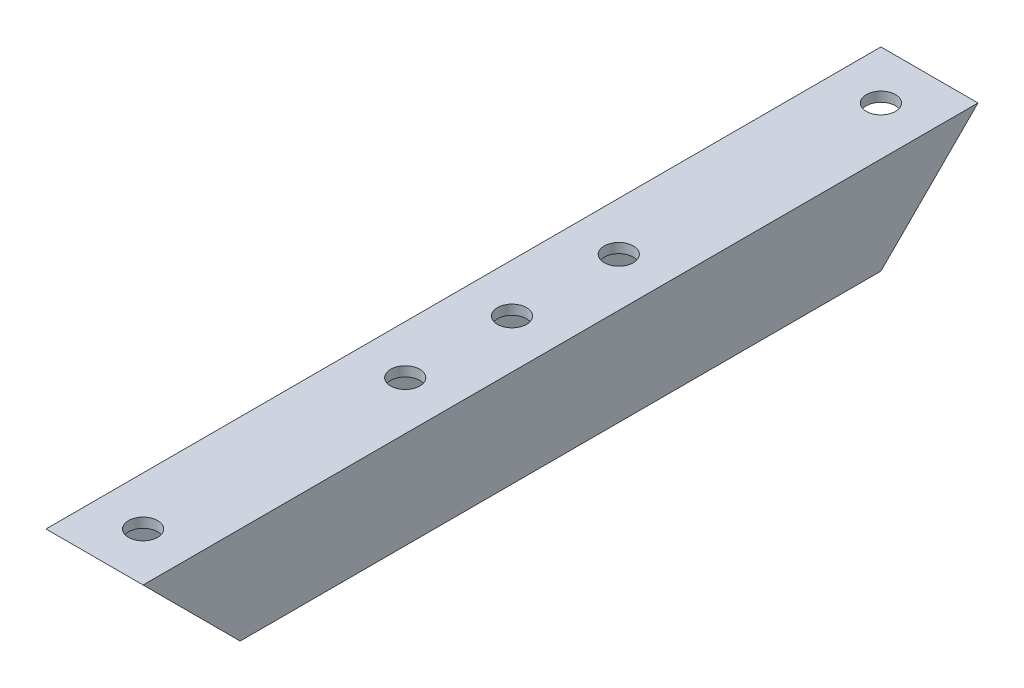
ISO-10303-21;
HEADER;
FILE_DESCRIPTION(('STEP AP214'),'2;1');
FILE_NAME('part.step','',(''),(''),'','','');
FILE_SCHEMA(('AUTOMOTIVE_DESIGN { 1 0 10303 214 1 1 1 1 }'));
ENDSEC;
DATA;
#1=APPLICATION_CONTEXT('core data for automotive mechanical design processes');
#2=APPLICATION_PROTOCOL_DEFINITION('international standard','automotive_design',2000,#1);
#3=PRODUCT_CONTEXT('',#1,'mechanical');
#4=PRODUCT('Part','Part','',(#3));
#5=PRODUCT_RELATED_PRODUCT_CATEGORY('part','',(#4));
#6=PRODUCT_DEFINITION_FORMATION('','',#4);
#7=PRODUCT_DEFINITION_CONTEXT('part definition',#1,'design');
#8=PRODUCT_DEFINITION('design','',#6,#7);
#9=PRODUCT_DEFINITION_SHAPE('','',#8);
#10=(LENGTH_UNIT() NAMED_UNIT(*) SI_UNIT(.MILLI.,.METRE.));
#11=(NAMED_UNIT(*) PLANE_ANGLE_UNIT() SI_UNIT($,.RADIAN.));
#12=(NAMED_UNIT(*) SI_UNIT($,.STERADIAN.) SOLID_ANGLE_UNIT());
#13=UNCERTAINTY_MEASURE_WITH_UNIT(LENGTH_MEASURE(1.E-05),#10,'distance_accuracy_value','');
#14=(GEOMETRIC_REPRESENTATION_CONTEXT(3) GLOBAL_UNCERTAINTY_ASSIGNED_CONTEXT((#13)) GLOBAL_UNIT_ASSIGNED_CONTEXT((#10,
#11,#12)) REPRESENTATION_CONTEXT('',''));
#15=CARTESIAN_POINT('',(0.,0.,0.));
#16=DIRECTION('',(0.,0.,1.));
#17=DIRECTION('',(1.,0.,0.));
#18=AXIS2_PLACEMENT_3D('',#15,#16,#17);
#19=CARTESIAN_POINT('',(-5.,5.,86.));
#20=DIRECTION('',(1.,0.,0.));
#21=DIRECTION('',(0.,0.,-1.));
#22=AXIS2_PLACEMENT_3D('',#19,#20,#21);
#23=PLANE('',#22);
#24=DIRECTION('',(0.,0.,-1.));
#25=VECTOR('',#24,1.);
#26=CARTESIAN_POINT('',(-5.,-5.,86.));
#27=LINE('',#26,#25);
#28=CARTESIAN_POINT('',(-4.99999999999999,-5.,76.0000000000001));
#29=VERTEX_POINT('',#28);
#30=CARTESIAN_POINT('',(-4.99999999999999,-5.,9.99999999999983));
#31=VERTEX_POINT('',#30);
#32=EDGE_CURVE('E143',#29,#31,#27,.T.);
#33=ORIENTED_EDGE('',*,*,#32,.F.);
#34=DIRECTION('',(0.,0.707106781186551,0.707106781186544));
#35=VECTOR('',#34,1.);
#36=CARTESIAN_POINT('',(-4.99999999999999,5.,86.));
#37=LINE('',#36,#35);
#38=CARTESIAN_POINT('',(-4.99999999999999,5.,86.));
#39=VERTEX_POINT('',#38);
#40=EDGE_CURVE('E125',#29,#39,#37,.T.);
#41=ORIENTED_EDGE('',*,*,#40,.T.);
#42=DIRECTION('',(0.,0.,-1.));
#43=VECTOR('',#42,1.);
#44=CARTESIAN_POINT('',(-5.,5.,86.));
#45=LINE('',#44,#43);
#46=CARTESIAN_POINT('',(-5.,5.,0.));
#47=VERTEX_POINT('',#46);
#48=EDGE_CURVE('E197',#39,#47,#45,.T.);
#49=ORIENTED_EDGE('',*,*,#48,.T.);
#50=DIRECTION('',(0.,-0.707106781186554,0.707106781186541));
#51=VECTOR('',#50,1.);
#52=CARTESIAN_POINT('',(-4.99999999999999,5.,0.));
#53=LINE('',#52,#51);
#54=EDGE_CURVE('E148',#47,#31,#53,.T.);
#55=ORIENTED_EDGE('',*,*,#54,.T.);
#56=EDGE_LOOP('',(#33,#41,#49,#55));
#57=FACE_BOUND('',#56,.T.);
#58=ADVANCED_FACE('F63',(#57),#23,.F.);
#59=CARTESIAN_POINT('',(-5.,-5.,86.));
#60=DIRECTION('',(0.,1.,0.));
#61=DIRECTION('',(0.,0.,1.));
#62=AXIS2_PLACEMENT_3D('',#59,#60,#61);
#63=PLANE('',#62);
#64=CARTESIAN_POINT('',(0.,-5.,32.));
#65=DIRECTION('',(0.,1.,0.));
#66=DIRECTION('',(0.,0.,1.));
#67=AXIS2_PLACEMENT_3D('',#64,#65,#66);
#68=CIRCLE('',#67,1.5);
#69=CARTESIAN_POINT('',(0.,-5.,33.5));
#70=VERTEX_POINT('',#69);
#71=EDGE_CURVE('E235',#70,#70,#68,.T.);
#72=ORIENTED_EDGE('',*,*,#71,.T.);
#73=EDGE_LOOP('',(#72));
#74=FACE_BOUND('',#73,.T.);
#75=CARTESIAN_POINT('',(0.,-5.,43.));
#76=DIRECTION('',(0.,1.,0.));
#77=DIRECTION('',(0.,0.,1.));
#78=AXIS2_PLACEMENT_3D('',#75,#76,#77);
#79=CIRCLE('',#78,1.5);
#80=CARTESIAN_POINT('',(0.,-5.,44.5));
#81=VERTEX_POINT('',#80);
#82=EDGE_CURVE('E228',#81,#81,#79,.T.);
#83=ORIENTED_EDGE('',*,*,#82,.T.);
#84=EDGE_LOOP('',(#83));
#85=FACE_BOUND('',#84,.T.);
#86=CARTESIAN_POINT('',(0.,-5.,54.));
#87=DIRECTION('',(0.,1.,0.));
#88=DIRECTION('',(0.,0.,1.));
#89=AXIS2_PLACEMENT_3D('',#86,#87,#88);
#90=CIRCLE('',#89,1.5);
#91=CARTESIAN_POINT('',(0.,-5.,55.5));
#92=VERTEX_POINT('',#91);
#93=EDGE_CURVE('E158',#92,#92,#90,.T.);
#94=ORIENTED_EDGE('',*,*,#93,.T.);
#95=EDGE_LOOP('',(#94));
#96=FACE_BOUND('',#95,.T.);
#97=DIRECTION('',(0.,0.,-1.));
#98=VECTOR('',#97,1.);
#99=CARTESIAN_POINT('',(5.00000000000001,-5.,86.));
#100=LINE('',#99,#98);
#101=CARTESIAN_POINT('',(5.00000000000001,-5.,76.0000000000001));
#102=VERTEX_POINT('',#101);
#103=CARTESIAN_POINT('',(5.00000000000001,-5.,9.99999999999983));
#104=VERTEX_POINT('',#103);
#105=EDGE_CURVE('E145',#102,#104,#100,.T.);
#106=ORIENTED_EDGE('',*,*,#105,.F.);
#107=DIRECTION('',(1.,0.,0.));
#108=VECTOR('',#107,1.);
#109=CARTESIAN_POINT('',(-4.99999999999999,-5.,76.0000000000001));
#110=LINE('',#109,#108);
#111=EDGE_CURVE('E128',#29,#102,#110,.T.);
#112=ORIENTED_EDGE('',*,*,#111,.F.);
#113=ORIENTED_EDGE('',*,*,#32,.T.);
#114=DIRECTION('',(1.,0.,0.));
#115=VECTOR('',#114,1.);
#116=CARTESIAN_POINT('',(-4.99999999999999,-5.,9.99999999999983));
#117=LINE('',#116,#115);
#118=EDGE_CURVE('E210',#31,#104,#117,.T.);
#119=ORIENTED_EDGE('',*,*,#118,.T.);
#120=EDGE_LOOP('',(#106,#112,#113,#119));
#121=FACE_BOUND('',#120,.T.);
#122=ADVANCED_FACE('F141',(#74,#85,#96,#121),#63,.F.);
#123=CARTESIAN_POINT('',(5.00000000000001,5.,86.));
#124=DIRECTION('',(-1.,0.,0.));
#125=DIRECTION('',(0.,0.,1.));
#126=AXIS2_PLACEMENT_3D('',#123,#124,#125);
#127=PLANE('',#126);
#128=DIRECTION('',(0.,0.,-1.));
#129=VECTOR('',#128,1.);
#130=CARTESIAN_POINT('',(5.00000000000001,5.,86.));
#131=LINE('',#130,#129);
#132=CARTESIAN_POINT('',(5.00000000000001,5.,86.));
#133=VERTEX_POINT('',#132);
#134=CARTESIAN_POINT('',(5.00000000000001,5.,0.));
#135=VERTEX_POINT('',#134);
#136=EDGE_CURVE('E150',#133,#135,#131,.T.);
#137=ORIENTED_EDGE('',*,*,#136,.F.);
#138=DIRECTION('',(0.,0.707106781186551,0.707106781186544));
#139=VECTOR('',#138,1.);
#140=CARTESIAN_POINT('',(5.00000000000001,5.,86.));
#141=LINE('',#140,#139);
#142=EDGE_CURVE('E136',#102,#133,#141,.T.);
#143=ORIENTED_EDGE('',*,*,#142,.F.);
#144=ORIENTED_EDGE('',*,*,#105,.T.);
#145=DIRECTION('',(0.,-0.707106781186554,0.707106781186541));
#146=VECTOR('',#145,1.);
#147=CARTESIAN_POINT('',(5.00000000000001,5.,0.));
#148=LINE('',#147,#146);
#149=EDGE_CURVE('E207',#135,#104,#148,.T.);
#150=ORIENTED_EDGE('',*,*,#149,.F.);
#151=EDGE_LOOP('',(#137,#143,#144,#150));
#152=FACE_BOUND('',#151,.T.);
#153=ADVANCED_FACE('F206',(#152),#127,.F.);
#154=CARTESIAN_POINT('',(-5.,5.,86.));
#155=DIRECTION('',(0.,-1.,0.));
#156=DIRECTION('',(0.,0.,-1.));
#157=AXIS2_PLACEMENT_3D('',#154,#155,#156);
#158=PLANE('',#157);
#159=CARTESIAN_POINT('',(0.,5.,32.));
#160=DIRECTION('',(0.,1.,0.));
#161=DIRECTION('',(0.,0.,1.));
#162=AXIS2_PLACEMENT_3D('',#159,#160,#161);
#163=CIRCLE('',#162,1.5);
#164=CARTESIAN_POINT('',(0.,5.,33.5));
#165=VERTEX_POINT('',#164);
#166=EDGE_CURVE('E231',#165,#165,#163,.T.);
#167=ORIENTED_EDGE('',*,*,#166,.F.);
#168=EDGE_LOOP('',(#167));
#169=FACE_BOUND('',#168,.T.);
#170=CARTESIAN_POINT('',(0.,5.,43.));
#171=DIRECTION('',(0.,1.,0.));
#172=DIRECTION('',(0.,0.,1.));
#173=AXIS2_PLACEMENT_3D('',#170,#171,#172);
#174=CIRCLE('',#173,1.5);
#175=CARTESIAN_POINT('',(0.,5.,44.5));
#176=VERTEX_POINT('',#175);
#177=EDGE_CURVE('E238',#176,#176,#174,.T.);
#178=ORIENTED_EDGE('',*,*,#177,.F.);
#179=EDGE_LOOP('',(#178));
#180=FACE_BOUND('',#179,.T.);
#181=CARTESIAN_POINT('',(0.,5.,81.));
#182=DIRECTION('',(0.,1.,0.));
#183=DIRECTION('',(0.,0.,1.));
#184=AXIS2_PLACEMENT_3D('',#181,#182,#183);
#185=CIRCLE('',#184,1.5);
#186=CARTESIAN_POINT('',(0.,5.,82.5));
#187=VERTEX_POINT('',#186);
#188=EDGE_CURVE('E225',#187,#187,#185,.T.);
#189=ORIENTED_EDGE('',*,*,#188,.F.);
#190=EDGE_LOOP('',(#189));
#191=FACE_BOUND('',#190,.T.);
#192=CARTESIAN_POINT('',(0.,5.,5.));
#193=DIRECTION('',(0.,1.,0.));
#194=DIRECTION('',(0.,0.,1.));
#195=AXIS2_PLACEMENT_3D('',#192,#193,#194);
#196=CIRCLE('',#195,1.5);
#197=CARTESIAN_POINT('',(0.,5.,6.50000000000001));
#198=VERTEX_POINT('',#197);
#199=EDGE_CURVE('E224',#198,#198,#196,.T.);
#200=ORIENTED_EDGE('',*,*,#199,.F.);
#201=EDGE_LOOP('',(#200));
#202=FACE_BOUND('',#201,.T.);
#203=CARTESIAN_POINT('',(0.,5.,54.));
#204=DIRECTION('',(0.,1.,0.));
#205=DIRECTION('',(0.,0.,1.));
#206=AXIS2_PLACEMENT_3D('',#203,#204,#205);
#207=CIRCLE('',#206,1.5);
#208=CARTESIAN_POINT('',(0.,5.,55.5));
#209=VERTEX_POINT('',#208);
#210=EDGE_CURVE('E234',#209,#209,#207,.T.);
#211=ORIENTED_EDGE('',*,*,#210,.F.);
#212=EDGE_LOOP('',(#211));
#213=FACE_BOUND('',#212,.T.);
#214=DIRECTION('',(-1.,0.,0.));
#215=VECTOR('',#214,1.);
#216=CARTESIAN_POINT('',(-5.,5.,0.));
#217=LINE('',#216,#215);
#218=EDGE_CURVE('E195',#135,#47,#217,.T.);
#219=ORIENTED_EDGE('',*,*,#218,.T.);
#220=ORIENTED_EDGE('',*,*,#48,.F.);
#221=DIRECTION('',(-1.,0.,0.));
#222=VECTOR('',#221,1.);
#223=CARTESIAN_POINT('',(-5.,5.,86.));
#224=LINE('',#223,#222);
#225=EDGE_CURVE('E131',#133,#39,#224,.T.);
#226=ORIENTED_EDGE('',*,*,#225,.F.);
#227=ORIENTED_EDGE('',*,*,#136,.T.);
#228=EDGE_LOOP('',(#219,#220,#226,#227));
#229=FACE_BOUND('',#228,.T.);
#230=ADVANCED_FACE('F203',(#169,#180,#191,#202,#213,#229),#158,.F.);
#231=CARTESIAN_POINT('',(-4.,5.,86.));
#232=DIRECTION('',(1.,0.,0.));
#233=DIRECTION('',(0.,0.,-1.));
#234=AXIS2_PLACEMENT_3D('',#231,#232,#233);
#235=PLANE('',#234);
#236=DIRECTION('',(0.,0.707106781186551,0.707106781186544));
#237=VECTOR('',#236,1.);
#238=CARTESIAN_POINT('',(-4.,5.,86.));
#239=LINE('',#238,#237);
#240=CARTESIAN_POINT('',(-4.,-4.,77.0000000000001));
#241=VERTEX_POINT('',#240);
#242=CARTESIAN_POINT('',(-4.,4.,85.));
#243=VERTEX_POINT('',#242);
#244=EDGE_CURVE('E76',#241,#243,#239,.T.);
#245=ORIENTED_EDGE('',*,*,#244,.F.);
#246=DIRECTION('',(0.,0.,-1.));
#247=VECTOR('',#246,1.);
#248=CARTESIAN_POINT('',(-4.,-4.,86.));
#249=LINE('',#248,#247);
#250=CARTESIAN_POINT('',(-4.,-4.,8.99999999999984));
#251=VERTEX_POINT('',#250);
#252=EDGE_CURVE('E192',#241,#251,#249,.T.);
#253=ORIENTED_EDGE('',*,*,#252,.T.);
#254=DIRECTION('',(0.,-0.707106781186554,0.707106781186541));
#255=VECTOR('',#254,1.);
#256=CARTESIAN_POINT('',(-4.,-38.,42.9999999999992));
#257=LINE('',#256,#255);
#258=CARTESIAN_POINT('',(-4.,4.,0.999999999999973));
#259=VERTEX_POINT('',#258);
#260=EDGE_CURVE('E217',#259,#251,#257,.T.);
#261=ORIENTED_EDGE('',*,*,#260,.F.);
#262=DIRECTION('',(0.,0.,-1.));
#263=VECTOR('',#262,1.);
#264=CARTESIAN_POINT('',(-4.,4.,86.));
#265=LINE('',#264,#263);
#266=EDGE_CURVE('E175',#243,#259,#265,.T.);
#267=ORIENTED_EDGE('',*,*,#266,.F.);
#268=EDGE_LOOP('',(#245,#253,#261,#267));
#269=FACE_BOUND('',#268,.T.);
#270=ADVANCED_FACE('F250',(#269),#235,.T.);
#271=CARTESIAN_POINT('',(-5.,-4.,86.));
#272=DIRECTION('',(0.,1.,0.));
#273=DIRECTION('',(0.,0.,1.));
#274=AXIS2_PLACEMENT_3D('',#271,#272,#273);
#275=PLANE('',#274);
#276=DIRECTION('',(-1.,0.,0.));
#277=VECTOR('',#276,1.);
#278=CARTESIAN_POINT('',(-5.,-4.,77.0000000000001));
#279=LINE('',#278,#277);
#280=CARTESIAN_POINT('',(4.00000000000001,-4.,77.0000000000001));
#281=VERTEX_POINT('',#280);
#282=EDGE_CURVE('E221',#281,#241,#279,.T.);
#283=ORIENTED_EDGE('',*,*,#282,.F.);
#284=DIRECTION('',(0.,0.,-1.));
#285=VECTOR('',#284,1.);
#286=CARTESIAN_POINT('',(4.00000000000001,-4.,86.));
#287=LINE('',#286,#285);
#288=CARTESIAN_POINT('',(4.00000000000001,-4.,8.99999999999985));
#289=VERTEX_POINT('',#288);
#290=EDGE_CURVE('E189',#281,#289,#287,.T.);
#291=ORIENTED_EDGE('',*,*,#290,.T.);
#292=DIRECTION('',(1.,0.,0.));
#293=VECTOR('',#292,1.);
#294=CARTESIAN_POINT('',(-5.,-4.,8.99999999999984));
#295=LINE('',#294,#293);
#296=EDGE_CURVE('E215',#251,#289,#295,.T.);
#297=ORIENTED_EDGE('',*,*,#296,.F.);
#298=ORIENTED_EDGE('',*,*,#252,.F.);
#299=EDGE_LOOP('',(#283,#291,#297,#298));
#300=FACE_BOUND('',#299,.T.);
#301=CARTESIAN_POINT('',(0.,-4.,32.));
#302=DIRECTION('',(0.,1.,0.));
#303=DIRECTION('',(0.,0.,1.));
#304=AXIS2_PLACEMENT_3D('',#301,#302,#303);
#305=CIRCLE('',#304,1.5);
#306=CARTESIAN_POINT('',(0.,-4.,33.5));
#307=VERTEX_POINT('',#306);
#308=EDGE_CURVE('E171',#307,#307,#305,.T.);
#309=ORIENTED_EDGE('',*,*,#308,.F.);
#310=EDGE_LOOP('',(#309));
#311=FACE_BOUND('',#310,.T.);
#312=CARTESIAN_POINT('',(0.,-4.,43.));
#313=DIRECTION('',(0.,1.,0.));
#314=DIRECTION('',(0.,0.,1.));
#315=AXIS2_PLACEMENT_3D('',#312,#313,#314);
#316=CIRCLE('',#315,1.5);
#317=CARTESIAN_POINT('',(0.,-4.,44.5));
#318=VERTEX_POINT('',#317);
#319=EDGE_CURVE('E168',#318,#318,#316,.T.);
#320=ORIENTED_EDGE('',*,*,#319,.F.);
#321=EDGE_LOOP('',(#320));
#322=FACE_BOUND('',#321,.T.);
#323=CARTESIAN_POINT('',(0.,-4.,54.));
#324=DIRECTION('',(0.,1.,0.));
#325=DIRECTION('',(0.,0.,1.));
#326=AXIS2_PLACEMENT_3D('',#323,#324,#325);
#327=CIRCLE('',#326,1.5);
#328=CARTESIAN_POINT('',(0.,-4.,55.5));
#329=VERTEX_POINT('',#328);
#330=EDGE_CURVE('E157',#329,#329,#327,.T.);
#331=ORIENTED_EDGE('',*,*,#330,.F.);
#332=EDGE_LOOP('',(#331));
#333=FACE_BOUND('',#332,.T.);
#334=ADVANCED_FACE('F257',(#300,#311,#322,#333),#275,.T.);
#335=CARTESIAN_POINT('',(4.00000000000001,5.,86.));
#336=DIRECTION('',(-1.,0.,0.));
#337=DIRECTION('',(0.,0.,1.));
#338=AXIS2_PLACEMENT_3D('',#335,#336,#337);
#339=PLANE('',#338);
#340=DIRECTION('',(0.,-0.707106781186551,-0.707106781186544));
#341=VECTOR('',#340,1.);
#342=CARTESIAN_POINT('',(4.00000000000001,5.,86.));
#343=LINE('',#342,#341);
#344=CARTESIAN_POINT('',(4.00000000000001,4.,85.));
#345=VERTEX_POINT('',#344);
#346=EDGE_CURVE('E219',#345,#281,#343,.T.);
#347=ORIENTED_EDGE('',*,*,#346,.F.);
#348=DIRECTION('',(0.,0.,-1.));
#349=VECTOR('',#348,1.);
#350=CARTESIAN_POINT('',(4.00000000000001,4.,86.));
#351=LINE('',#350,#349);
#352=CARTESIAN_POINT('',(4.00000000000001,4.,0.999999999999973));
#353=VERTEX_POINT('',#352);
#354=EDGE_CURVE('E186',#345,#353,#351,.T.);
#355=ORIENTED_EDGE('',*,*,#354,.T.);
#356=DIRECTION('',(0.,0.707106781186554,-0.707106781186541));
#357=VECTOR('',#356,1.);
#358=CARTESIAN_POINT('',(4.00000000000001,-38.,42.9999999999992));
#359=LINE('',#358,#357);
#360=EDGE_CURVE('E84',#289,#353,#359,.T.);
#361=ORIENTED_EDGE('',*,*,#360,.F.);
#362=ORIENTED_EDGE('',*,*,#290,.F.);
#363=EDGE_LOOP('',(#347,#355,#361,#362));
#364=FACE_BOUND('',#363,.T.);
#365=ADVANCED_FACE('F303',(#364),#339,.T.);
#366=CARTESIAN_POINT('',(-5.,4.,86.));
#367=DIRECTION('',(0.,-1.,0.));
#368=DIRECTION('',(0.,0.,-1.));
#369=AXIS2_PLACEMENT_3D('',#366,#367,#368);
#370=PLANE('',#369);
#371=DIRECTION('',(1.,0.,0.));
#372=VECTOR('',#371,1.);
#373=CARTESIAN_POINT('',(-5.,4.,85.));
#374=LINE('',#373,#372);
#375=EDGE_CURVE('E12',#243,#345,#374,.T.);
#376=ORIENTED_EDGE('',*,*,#375,.F.);
#377=ORIENTED_EDGE('',*,*,#266,.T.);
#378=DIRECTION('',(-1.,0.,0.));
#379=VECTOR('',#378,1.);
#380=CARTESIAN_POINT('',(-5.,4.,0.999999999999973));
#381=LINE('',#380,#379);
#382=EDGE_CURVE('E70',#353,#259,#381,.T.);
#383=ORIENTED_EDGE('',*,*,#382,.F.);
#384=ORIENTED_EDGE('',*,*,#354,.F.);
#385=EDGE_LOOP('',(#376,#377,#383,#384));
#386=FACE_BOUND('',#385,.T.);
#387=CARTESIAN_POINT('',(0.,4.,32.));
#388=DIRECTION('',(0.,-1.,0.));
#389=DIRECTION('',(0.,0.,-1.));
#390=AXIS2_PLACEMENT_3D('',#387,#388,#389);
#391=CIRCLE('',#390,1.5);
#392=CARTESIAN_POINT('',(0.,4.,30.5));
#393=VERTEX_POINT('',#392);
#394=EDGE_CURVE('E169',#393,#393,#391,.T.);
#395=ORIENTED_EDGE('',*,*,#394,.F.);
#396=EDGE_LOOP('',(#395));
#397=FACE_BOUND('',#396,.T.);
#398=CARTESIAN_POINT('',(0.,4.,43.));
#399=DIRECTION('',(0.,-1.,0.));
#400=DIRECTION('',(0.,0.,-1.));
#401=AXIS2_PLACEMENT_3D('',#398,#399,#400);
#402=CIRCLE('',#401,1.5);
#403=CARTESIAN_POINT('',(0.,4.,41.5));
#404=VERTEX_POINT('',#403);
#405=EDGE_CURVE('E165',#404,#404,#402,.T.);
#406=ORIENTED_EDGE('',*,*,#405,.F.);
#407=EDGE_LOOP('',(#406));
#408=FACE_BOUND('',#407,.T.);
#409=CARTESIAN_POINT('',(0.,4.,81.));
#410=DIRECTION('',(0.,-1.,0.));
#411=DIRECTION('',(0.,0.,-1.));
#412=AXIS2_PLACEMENT_3D('',#409,#410,#411);
#413=CIRCLE('',#412,1.5);
#414=CARTESIAN_POINT('',(0.,4.,79.5));
#415=VERTEX_POINT('',#414);
#416=EDGE_CURVE('E162',#415,#415,#413,.T.);
#417=ORIENTED_EDGE('',*,*,#416,.F.);
#418=EDGE_LOOP('',(#417));
#419=FACE_BOUND('',#418,.T.);
#420=CARTESIAN_POINT('',(0.,4.,5.));
#421=DIRECTION('',(0.,-1.,0.));
#422=DIRECTION('',(0.,0.,-1.));
#423=AXIS2_PLACEMENT_3D('',#420,#421,#422);
#424=CIRCLE('',#423,1.5);
#425=CARTESIAN_POINT('',(0.,4.,3.5));
#426=VERTEX_POINT('',#425);
#427=EDGE_CURVE('E159',#426,#426,#424,.T.);
#428=ORIENTED_EDGE('',*,*,#427,.F.);
#429=EDGE_LOOP('',(#428));
#430=FACE_BOUND('',#429,.T.);
#431=CARTESIAN_POINT('',(0.,4.,54.));
#432=DIRECTION('',(0.,-1.,0.));
#433=DIRECTION('',(0.,0.,-1.));
#434=AXIS2_PLACEMENT_3D('',#431,#432,#433);
#435=CIRCLE('',#434,1.5);
#436=CARTESIAN_POINT('',(0.,4.,52.5));
#437=VERTEX_POINT('',#436);
#438=EDGE_CURVE('E154',#437,#437,#435,.T.);
#439=ORIENTED_EDGE('',*,*,#438,.F.);
#440=EDGE_LOOP('',(#439));
#441=FACE_BOUND('',#440,.T.);
#442=ADVANCED_FACE('F294',(#386,#397,#408,#419,#430,#441),#370,.T.);
#443=CARTESIAN_POINT('',(0.,-5.,54.));
#444=DIRECTION('',(0.,1.,0.));
#445=DIRECTION('',(0.,0.,1.));
#446=AXIS2_PLACEMENT_3D('',#443,#444,#445);
#447=CYLINDRICAL_SURFACE('',#446,1.5);
#448=ORIENTED_EDGE('',*,*,#438,.T.);
#449=EDGE_LOOP('',(#448));
#450=FACE_BOUND('',#449,.T.);
#451=ORIENTED_EDGE('',*,*,#210,.T.);
#452=EDGE_LOOP('',(#451));
#453=FACE_BOUND('',#452,.T.);
#454=ADVANCED_FACE('F247',(#450,#453),#447,.F.);
#455=CARTESIAN_POINT('',(0.,-5.,5.));
#456=DIRECTION('',(0.,1.,0.));
#457=DIRECTION('',(0.,0.,1.));
#458=AXIS2_PLACEMENT_3D('',#455,#456,#457);
#459=CYLINDRICAL_SURFACE('',#458,1.5);
#460=ORIENTED_EDGE('',*,*,#427,.T.);
#461=EDGE_LOOP('',(#460));
#462=FACE_BOUND('',#461,.T.);
#463=ORIENTED_EDGE('',*,*,#199,.T.);
#464=EDGE_LOOP('',(#463));
#465=FACE_BOUND('',#464,.T.);
#466=ADVANCED_FACE('F293',(#462,#465),#459,.F.);
#467=CARTESIAN_POINT('',(0.,-5.,81.));
#468=DIRECTION('',(0.,1.,0.));
#469=DIRECTION('',(0.,0.,1.));
#470=AXIS2_PLACEMENT_3D('',#467,#468,#469);
#471=CYLINDRICAL_SURFACE('',#470,1.5);
#472=ORIENTED_EDGE('',*,*,#416,.T.);
#473=EDGE_LOOP('',(#472));
#474=FACE_BOUND('',#473,.T.);
#475=ORIENTED_EDGE('',*,*,#188,.T.);
#476=EDGE_LOOP('',(#475));
#477=FACE_BOUND('',#476,.T.);
#478=ADVANCED_FACE('F300',(#474,#477),#471,.F.);
#479=CARTESIAN_POINT('',(0.,-5.,43.));
#480=DIRECTION('',(0.,1.,0.));
#481=DIRECTION('',(0.,0.,1.));
#482=AXIS2_PLACEMENT_3D('',#479,#480,#481);
#483=CYLINDRICAL_SURFACE('',#482,1.5);
#484=ORIENTED_EDGE('',*,*,#405,.T.);
#485=EDGE_LOOP('',(#484));
#486=FACE_BOUND('',#485,.T.);
#487=ORIENTED_EDGE('',*,*,#177,.T.);
#488=EDGE_LOOP('',(#487));
#489=FACE_BOUND('',#488,.T.);
#490=ADVANCED_FACE('F288',(#486,#489),#483,.F.);
#491=CARTESIAN_POINT('',(0.,-5.,32.));
#492=DIRECTION('',(0.,1.,0.));
#493=DIRECTION('',(0.,0.,1.));
#494=AXIS2_PLACEMENT_3D('',#491,#492,#493);
#495=CYLINDRICAL_SURFACE('',#494,1.5);
#496=ORIENTED_EDGE('',*,*,#394,.T.);
#497=EDGE_LOOP('',(#496));
#498=FACE_BOUND('',#497,.T.);
#499=ORIENTED_EDGE('',*,*,#166,.T.);
#500=EDGE_LOOP('',(#499));
#501=FACE_BOUND('',#500,.T.);
#502=ADVANCED_FACE('F279',(#498,#501),#495,.F.);
#503=ORIENTED_EDGE('',*,*,#330,.T.);
#504=EDGE_LOOP('',(#503));
#505=FACE_BOUND('',#504,.T.);
#506=ORIENTED_EDGE('',*,*,#93,.F.);
#507=EDGE_LOOP('',(#506));
#508=FACE_BOUND('',#507,.T.);
#509=ADVANCED_FACE('F276',(#505,#508),#447,.F.);
#510=ORIENTED_EDGE('',*,*,#319,.T.);
#511=EDGE_LOOP('',(#510));
#512=FACE_BOUND('',#511,.T.);
#513=ORIENTED_EDGE('',*,*,#82,.F.);
#514=EDGE_LOOP('',(#513));
#515=FACE_BOUND('',#514,.T.);
#516=ADVANCED_FACE('F278',(#512,#515),#483,.F.);
#517=ORIENTED_EDGE('',*,*,#308,.T.);
#518=EDGE_LOOP('',(#517));
#519=FACE_BOUND('',#518,.T.);
#520=ORIENTED_EDGE('',*,*,#71,.F.);
#521=EDGE_LOOP('',(#520));
#522=FACE_BOUND('',#521,.T.);
#523=ADVANCED_FACE('F286',(#519,#522),#495,.F.);
#524=CARTESIAN_POINT('',(-4.99999999999999,5.,0.));
#525=DIRECTION('',(0.,0.707106781186541,0.707106781186554));
#526=DIRECTION('',(0.,-0.707106781186554,0.707106781186541));
#527=AXIS2_PLACEMENT_3D('',#524,#525,#526);
#528=PLANE('',#527);
#529=ORIENTED_EDGE('',*,*,#260,.T.);
#530=ORIENTED_EDGE('',*,*,#296,.T.);
#531=ORIENTED_EDGE('',*,*,#360,.T.);
#532=ORIENTED_EDGE('',*,*,#382,.T.);
#533=EDGE_LOOP('',(#529,#530,#531,#532));
#534=FACE_BOUND('',#533,.T.);
#535=ORIENTED_EDGE('',*,*,#149,.T.);
#536=ORIENTED_EDGE('',*,*,#118,.F.);
#537=ORIENTED_EDGE('',*,*,#54,.F.);
#538=ORIENTED_EDGE('',*,*,#218,.F.);
#539=EDGE_LOOP('',(#535,#536,#537,#538));
#540=FACE_BOUND('',#539,.T.);
#541=ADVANCED_FACE('F329',(#534,#540),#528,.F.);
#542=CARTESIAN_POINT('',(-4.99999999999999,5.,86.));
#543=DIRECTION('',(0.,0.707106781186544,-0.707106781186551));
#544=DIRECTION('',(0.,0.707106781186551,0.707106781186544));
#545=AXIS2_PLACEMENT_3D('',#542,#543,#544);
#546=PLANE('',#545);
#547=ORIENTED_EDGE('',*,*,#244,.T.);
#548=ORIENTED_EDGE('',*,*,#375,.T.);
#549=ORIENTED_EDGE('',*,*,#346,.T.);
#550=ORIENTED_EDGE('',*,*,#282,.T.);
#551=EDGE_LOOP('',(#547,#548,#549,#550));
#552=FACE_BOUND('',#551,.T.);
#553=ORIENTED_EDGE('',*,*,#142,.T.);
#554=ORIENTED_EDGE('',*,*,#225,.T.);
#555=ORIENTED_EDGE('',*,*,#40,.F.);
#556=ORIENTED_EDGE('',*,*,#111,.T.);
#557=EDGE_LOOP('',(#553,#554,#555,#556));
#558=FACE_BOUND('',#557,.T.);
#559=ADVANCED_FACE('F127',(#552,#558),#546,.F.);
#560=CLOSED_SHELL('',(#58,#122,#153,#230,#270,#334,#365,#442,#454,#466,#478,#490,#502,#509,#516,
#523,#541,#559));
#561=MANIFOLD_SOLID_BREP('B2',#560);
#562=ADVANCED_BREP_SHAPE_REPRESENTATION('',(#18,#561),#14);
#563=SHAPE_DEFINITION_REPRESENTATION(#9,#562);
ENDSEC;
END-ISO-10303-21;
